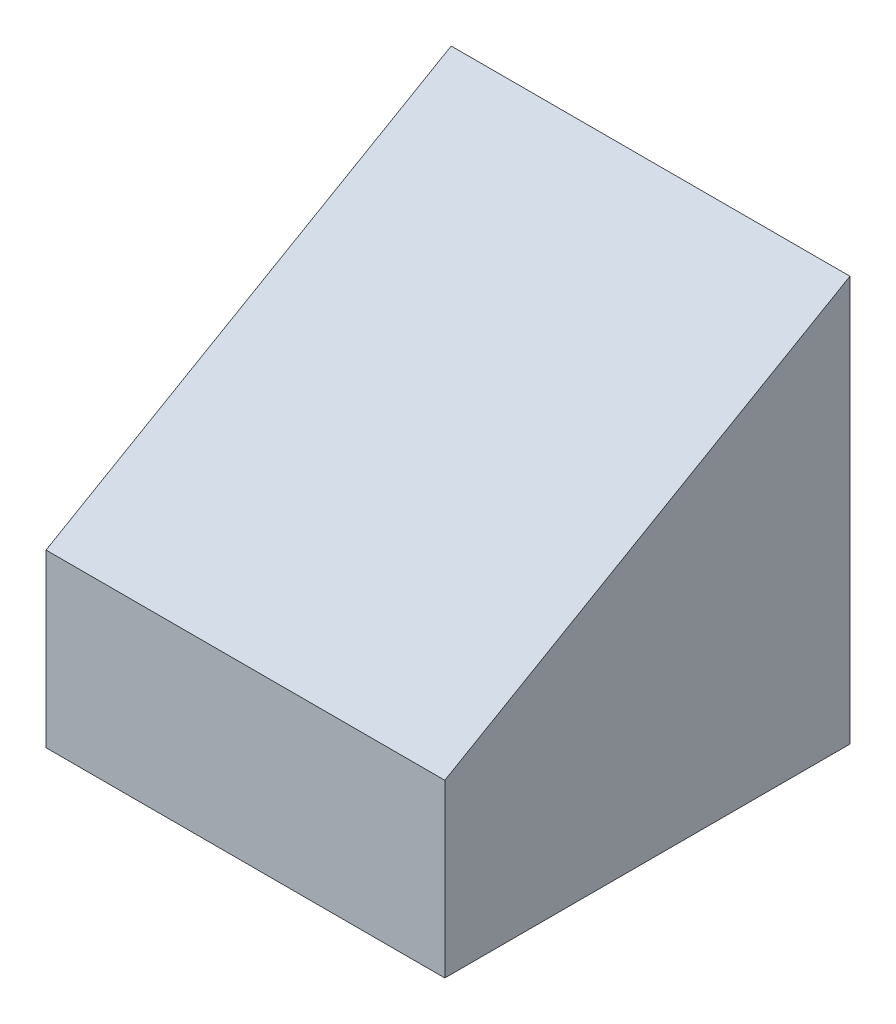
ISO-10303-21;
HEADER;
FILE_DESCRIPTION(('STEP AP214'),'2;1');
FILE_NAME('part.step','',(''),(''),'','','');
FILE_SCHEMA(('AUTOMOTIVE_DESIGN { 1 0 10303 214 1 1 1 1 }'));
ENDSEC;
DATA;
#1=APPLICATION_CONTEXT('core data for automotive mechanical design processes');
#2=APPLICATION_PROTOCOL_DEFINITION('international standard','automotive_design',2000,#1);
#3=PRODUCT_CONTEXT('',#1,'mechanical');
#4=PRODUCT('Part','Part','',(#3));
#5=PRODUCT_RELATED_PRODUCT_CATEGORY('part','',(#4));
#6=PRODUCT_DEFINITION_FORMATION('','',#4);
#7=PRODUCT_DEFINITION_CONTEXT('part definition',#1,'design');
#8=PRODUCT_DEFINITION('design','',#6,#7);
#9=PRODUCT_DEFINITION_SHAPE('','',#8);
#10=(LENGTH_UNIT() NAMED_UNIT(*) SI_UNIT(.MILLI.,.METRE.));
#11=(NAMED_UNIT(*) PLANE_ANGLE_UNIT() SI_UNIT($,.RADIAN.));
#12=(NAMED_UNIT(*) SI_UNIT($,.STERADIAN.) SOLID_ANGLE_UNIT());
#13=UNCERTAINTY_MEASURE_WITH_UNIT(LENGTH_MEASURE(1.E-05),#10,'distance_accuracy_value','');
#14=(GEOMETRIC_REPRESENTATION_CONTEXT(3) GLOBAL_UNCERTAINTY_ASSIGNED_CONTEXT((#13)) GLOBAL_UNIT_ASSIGNED_CONTEXT((#10,
#11,#12)) REPRESENTATION_CONTEXT('',''));
#15=CARTESIAN_POINT('',(0.,0.,0.));
#16=DIRECTION('',(0.,0.,1.));
#17=DIRECTION('',(1.,0.,0.));
#18=AXIS2_PLACEMENT_3D('',#15,#16,#17);
#19=CARTESIAN_POINT('',(12.5,0.,25.4));
#20=DIRECTION('',(0.,1.,0.));
#21=DIRECTION('',(0.,0.,1.));
#22=AXIS2_PLACEMENT_3D('',#19,#20,#21);
#23=PLANE('',#22);
#24=CARTESIAN_POINT('',(0.,0.,12.7));
#25=DIRECTION('',(0.,-1.,0.));
#26=DIRECTION('',(0.,0.,-1.));
#27=AXIS2_PLACEMENT_3D('',#24,#25,#26);
#28=CIRCLE('',#27,1.89865);
#29=CARTESIAN_POINT('',(0.,0.,10.80135));
#30=VERTEX_POINT('',#29);
#31=EDGE_CURVE('E105',#30,#30,#28,.T.);
#32=ORIENTED_EDGE('',*,*,#31,.F.);
#33=EDGE_LOOP('',(#32));
#34=FACE_BOUND('',#33,.T.);
#35=DIRECTION('',(0.,0.,-1.));
#36=VECTOR('',#35,1.);
#37=CARTESIAN_POINT('',(-12.5,0.,25.4));
#38=LINE('',#37,#36);
#39=CARTESIAN_POINT('',(-12.5,0.,25.4));
#40=VERTEX_POINT('',#39);
#41=CARTESIAN_POINT('',(-12.5,0.,0.));
#42=VERTEX_POINT('',#41);
#43=EDGE_CURVE('E104',#40,#42,#38,.T.);
#44=ORIENTED_EDGE('',*,*,#43,.T.);
#45=DIRECTION('',(-1.,0.,0.));
#46=VECTOR('',#45,1.);
#47=CARTESIAN_POINT('',(12.5,0.,0.));
#48=LINE('',#47,#46);
#49=CARTESIAN_POINT('',(12.5,0.,0.));
#50=VERTEX_POINT('',#49);
#51=EDGE_CURVE('E11',#50,#42,#48,.T.);
#52=ORIENTED_EDGE('',*,*,#51,.F.);
#53=DIRECTION('',(0.,0.,-1.));
#54=VECTOR('',#53,1.);
#55=CARTESIAN_POINT('',(12.5,0.,25.4));
#56=LINE('',#55,#54);
#57=CARTESIAN_POINT('',(12.5,0.,25.4));
#58=VERTEX_POINT('',#57);
#59=EDGE_CURVE('E115',#58,#50,#56,.T.);
#60=ORIENTED_EDGE('',*,*,#59,.F.);
#61=DIRECTION('',(-1.,0.,0.));
#62=VECTOR('',#61,1.);
#63=CARTESIAN_POINT('',(12.5,0.,25.4));
#64=LINE('',#63,#62);
#65=EDGE_CURVE('E124',#58,#40,#64,.T.);
#66=ORIENTED_EDGE('',*,*,#65,.T.);
#67=EDGE_LOOP('',(#44,#52,#60,#66));
#68=FACE_BOUND('',#67,.T.);
#69=ADVANCED_FACE('F41',(#34,#68),#23,.F.);
#70=CARTESIAN_POINT('',(12.5,0.,0.));
#71=DIRECTION('',(0.,0.,1.));
#72=DIRECTION('',(1.,0.,0.));
#73=AXIS2_PLACEMENT_3D('',#70,#71,#72);
#74=PLANE('',#73);
#75=DIRECTION('',(0.,1.,0.));
#76=VECTOR('',#75,1.);
#77=CARTESIAN_POINT('',(-12.5,0.,0.));
#78=LINE('',#77,#76);
#79=CARTESIAN_POINT('',(-12.5,25.4,0.));
#80=VERTEX_POINT('',#79);
#81=EDGE_CURVE('E110',#42,#80,#78,.T.);
#82=ORIENTED_EDGE('',*,*,#81,.T.);
#83=DIRECTION('',(-1.,0.,0.));
#84=VECTOR('',#83,1.);
#85=CARTESIAN_POINT('',(12.5,25.4,0.));
#86=LINE('',#85,#84);
#87=CARTESIAN_POINT('',(12.5,25.4,0.));
#88=VERTEX_POINT('',#87);
#89=EDGE_CURVE('E50',#88,#80,#86,.T.);
#90=ORIENTED_EDGE('',*,*,#89,.F.);
#91=DIRECTION('',(0.,1.,0.));
#92=VECTOR('',#91,1.);
#93=CARTESIAN_POINT('',(12.5,0.,0.));
#94=LINE('',#93,#92);
#95=EDGE_CURVE('E89',#50,#88,#94,.T.);
#96=ORIENTED_EDGE('',*,*,#95,.F.);
#97=ORIENTED_EDGE('',*,*,#51,.T.);
#98=EDGE_LOOP('',(#82,#90,#96,#97));
#99=FACE_BOUND('',#98,.T.);
#100=ADVANCED_FACE('F153',(#99),#74,.F.);
#101=CARTESIAN_POINT('',(12.5,25.4,0.));
#102=DIRECTION('',(0.,-0.866025403784442,-0.499999999999995));
#103=DIRECTION('',(0.,0.499999999999995,-0.866025403784442));
#104=AXIS2_PLACEMENT_3D('',#101,#102,#103);
#105=PLANE('',#104);
#106=DIRECTION('',(0.,-0.499999999999995,0.866025403784441));
#107=VECTOR('',#106,1.);
#108=CARTESIAN_POINT('',(-12.5,25.4,0.));
#109=LINE('',#108,#107);
#110=CARTESIAN_POINT('',(-12.5,10.7353031625837,25.4));
#111=VERTEX_POINT('',#110);
#112=EDGE_CURVE('E76',#80,#111,#109,.T.);
#113=ORIENTED_EDGE('',*,*,#112,.T.);
#114=DIRECTION('',(-1.,0.,0.));
#115=VECTOR('',#114,1.);
#116=CARTESIAN_POINT('',(12.5,10.7353031625837,25.4));
#117=LINE('',#116,#115);
#118=CARTESIAN_POINT('',(12.5,10.7353031625837,25.4));
#119=VERTEX_POINT('',#118);
#120=EDGE_CURVE('E134',#119,#111,#117,.T.);
#121=ORIENTED_EDGE('',*,*,#120,.F.);
#122=DIRECTION('',(0.,-0.499999999999995,0.866025403784441));
#123=VECTOR('',#122,1.);
#124=CARTESIAN_POINT('',(12.5,25.4,0.));
#125=LINE('',#124,#123);
#126=EDGE_CURVE('E120',#88,#119,#125,.T.);
#127=ORIENTED_EDGE('',*,*,#126,.F.);
#128=ORIENTED_EDGE('',*,*,#89,.T.);
#129=EDGE_LOOP('',(#113,#121,#127,#128));
#130=FACE_BOUND('',#129,.T.);
#131=ADVANCED_FACE('F138',(#130),#105,.F.);
#132=CARTESIAN_POINT('',(12.5,10.7353031625837,25.4));
#133=DIRECTION('',(0.,0.,-1.));
#134=DIRECTION('',(-1.,0.,0.));
#135=AXIS2_PLACEMENT_3D('',#132,#133,#134);
#136=PLANE('',#135);
#137=DIRECTION('',(0.,-1.,0.));
#138=VECTOR('',#137,1.);
#139=CARTESIAN_POINT('',(-12.5,10.7353031625837,25.4));
#140=LINE('',#139,#138);
#141=EDGE_CURVE('E82',#111,#40,#140,.T.);
#142=ORIENTED_EDGE('',*,*,#141,.T.);
#143=ORIENTED_EDGE('',*,*,#65,.F.);
#144=DIRECTION('',(0.,-1.,0.));
#145=VECTOR('',#144,1.);
#146=CARTESIAN_POINT('',(12.5,10.7353031625837,25.4));
#147=LINE('',#146,#145);
#148=EDGE_CURVE('E58',#119,#58,#147,.T.);
#149=ORIENTED_EDGE('',*,*,#148,.F.);
#150=ORIENTED_EDGE('',*,*,#120,.T.);
#151=EDGE_LOOP('',(#142,#143,#149,#150));
#152=FACE_BOUND('',#151,.T.);
#153=ADVANCED_FACE('F144',(#152),#136,.F.);
#154=CARTESIAN_POINT('',(12.5,0.,0.));
#155=DIRECTION('',(1.,0.,0.));
#156=DIRECTION('',(0.,0.,-1.));
#157=AXIS2_PLACEMENT_3D('',#154,#155,#156);
#158=PLANE('',#157);
#159=ORIENTED_EDGE('',*,*,#59,.T.);
#160=ORIENTED_EDGE('',*,*,#95,.T.);
#161=ORIENTED_EDGE('',*,*,#126,.T.);
#162=ORIENTED_EDGE('',*,*,#148,.T.);
#163=EDGE_LOOP('',(#159,#160,#161,#162));
#164=FACE_BOUND('',#163,.T.);
#165=ADVANCED_FACE('F146',(#164),#158,.T.);
#166=CARTESIAN_POINT('',(-12.5,0.,0.));
#167=DIRECTION('',(1.,0.,0.));
#168=DIRECTION('',(0.,0.,-1.));
#169=AXIS2_PLACEMENT_3D('',#166,#167,#168);
#170=PLANE('',#169);
#171=ORIENTED_EDGE('',*,*,#43,.F.);
#172=ORIENTED_EDGE('',*,*,#141,.F.);
#173=ORIENTED_EDGE('',*,*,#112,.F.);
#174=ORIENTED_EDGE('',*,*,#81,.F.);
#175=EDGE_LOOP('',(#171,#172,#173,#174));
#176=FACE_BOUND('',#175,.T.);
#177=ADVANCED_FACE('F97',(#176),#170,.F.);
#178=CARTESIAN_POINT('',(0.,12.83,12.7));
#179=DIRECTION('',(0.,-1.,0.));
#180=DIRECTION('',(0.,0.,-1.));
#181=AXIS2_PLACEMENT_3D('',#178,#179,#180);
#182=CONICAL_SURFACE('',#181,1.89865,1.02974425867665);
#183=CARTESIAN_POINT('',(0.,13.9708240143167,12.7));
#184=VERTEX_POINT('',#183);
#185=VERTEX_LOOP('',#184);
#186=FACE_BOUND('',#185,.T.);
#187=CARTESIAN_POINT('',(0.,12.83,12.7));
#188=DIRECTION('',(0.,-1.,0.));
#189=DIRECTION('',(0.,0.,-1.));
#190=AXIS2_PLACEMENT_3D('',#187,#188,#189);
#191=CIRCLE('',#190,1.89865);
#192=CARTESIAN_POINT('',(0.,12.83,10.80135));
#193=VERTEX_POINT('',#192);
#194=EDGE_CURVE('E101',#193,#193,#191,.T.);
#195=ORIENTED_EDGE('',*,*,#194,.T.);
#196=EDGE_LOOP('',(#195));
#197=FACE_BOUND('',#196,.T.);
#198=ADVANCED_FACE('F93',(#186,#197),#182,.F.);
#199=CARTESIAN_POINT('',(0.,0.,12.7));
#200=DIRECTION('',(0.,-1.,0.));
#201=DIRECTION('',(0.,0.,-1.));
#202=AXIS2_PLACEMENT_3D('',#199,#200,#201);
#203=CYLINDRICAL_SURFACE('',#202,1.89865);
#204=ORIENTED_EDGE('',*,*,#194,.F.);
#205=EDGE_LOOP('',(#204));
#206=FACE_BOUND('',#205,.T.);
#207=ORIENTED_EDGE('',*,*,#31,.T.);
#208=EDGE_LOOP('',(#207));
#209=FACE_BOUND('',#208,.T.);
#210=ADVANCED_FACE('F96',(#206,#209),#203,.F.);
#211=CLOSED_SHELL('',(#69,#100,#131,#153,#165,#177,#198,#210));
#212=MANIFOLD_SOLID_BREP('B2',#211);
#213=ADVANCED_BREP_SHAPE_REPRESENTATION('',(#18,#212),#14);
#214=SHAPE_DEFINITION_REPRESENTATION(#9,#213);
ENDSEC;
END-ISO-10303-21;
